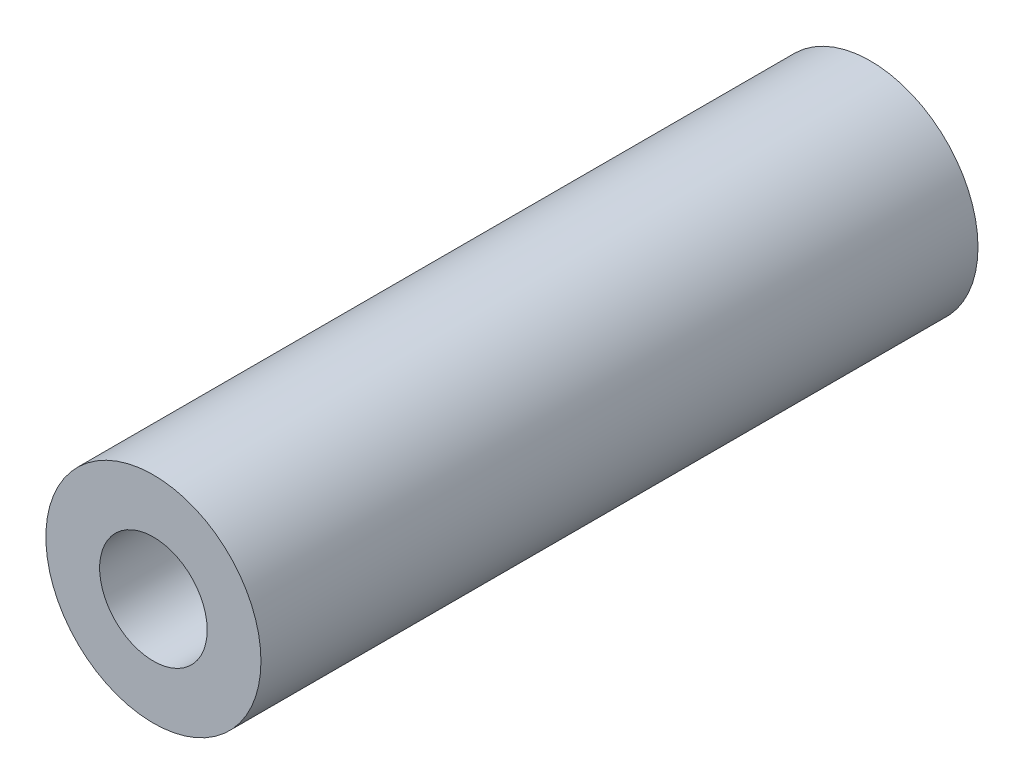
ISO-10303-21;
HEADER;
FILE_DESCRIPTION(('STEP AP214'),'2;1');
FILE_NAME('part.step','',(''),(''),'','','');
FILE_SCHEMA(('AUTOMOTIVE_DESIGN { 1 0 10303 214 1 1 1 1 }'));
ENDSEC;
DATA;
#1=APPLICATION_CONTEXT('core data for automotive mechanical design processes');
#2=APPLICATION_PROTOCOL_DEFINITION('international standard','automotive_design',2000,#1);
#3=PRODUCT_CONTEXT('',#1,'mechanical');
#4=PRODUCT('Part','Part','',(#3));
#5=PRODUCT_RELATED_PRODUCT_CATEGORY('part','',(#4));
#6=PRODUCT_DEFINITION_FORMATION('','',#4);
#7=PRODUCT_DEFINITION_CONTEXT('part definition',#1,'design');
#8=PRODUCT_DEFINITION('design','',#6,#7);
#9=PRODUCT_DEFINITION_SHAPE('','',#8);
#10=(LENGTH_UNIT() NAMED_UNIT(*) SI_UNIT(.MILLI.,.METRE.));
#11=(NAMED_UNIT(*) PLANE_ANGLE_UNIT() SI_UNIT($,.RADIAN.));
#12=(NAMED_UNIT(*) SI_UNIT($,.STERADIAN.) SOLID_ANGLE_UNIT());
#13=UNCERTAINTY_MEASURE_WITH_UNIT(LENGTH_MEASURE(1.E-05),#10,'distance_accuracy_value','');
#14=(GEOMETRIC_REPRESENTATION_CONTEXT(3) GLOBAL_UNCERTAINTY_ASSIGNED_CONTEXT((#13)) GLOBAL_UNIT_ASSIGNED_CONTEXT((#10,
#11,#12)) REPRESENTATION_CONTEXT('',''));
#15=CARTESIAN_POINT('',(0.,0.,0.));
#16=DIRECTION('',(0.,0.,1.));
#17=DIRECTION('',(1.,0.,0.));
#18=AXIS2_PLACEMENT_3D('',#15,#16,#17);
#19=CARTESIAN_POINT('',(0.,0.,20.));
#20=DIRECTION('',(0.,0.,1.));
#21=DIRECTION('',(1.,0.,0.));
#22=AXIS2_PLACEMENT_3D('',#19,#20,#21);
#23=PLANE('',#22);
#24=CARTESIAN_POINT('',(0.,0.,20.));
#25=DIRECTION('',(0.,0.,1.));
#26=DIRECTION('',(1.,0.,0.));
#27=AXIS2_PLACEMENT_3D('',#24,#25,#26);
#28=CIRCLE('',#27,3.);
#29=CARTESIAN_POINT('',(3.,0.,20.));
#30=VERTEX_POINT('',#29);
#31=EDGE_CURVE('E10',#30,#30,#28,.T.);
#32=ORIENTED_EDGE('',*,*,#31,.T.);
#33=EDGE_LOOP('',(#32));
#34=FACE_BOUND('',#33,.T.);
#35=CARTESIAN_POINT('',(0.,0.,20.));
#36=DIRECTION('',(0.,0.,1.));
#37=DIRECTION('',(1.,0.,0.));
#38=AXIS2_PLACEMENT_3D('',#35,#36,#37);
#39=CIRCLE('',#38,1.5);
#40=CARTESIAN_POINT('',(1.5,0.,20.));
#41=VERTEX_POINT('',#40);
#42=EDGE_CURVE('E42',#41,#41,#39,.T.);
#43=ORIENTED_EDGE('',*,*,#42,.F.);
#44=EDGE_LOOP('',(#43));
#45=FACE_BOUND('',#44,.T.);
#46=ADVANCED_FACE('F31',(#34,#45),#23,.T.);
#47=CARTESIAN_POINT('',(0.,0.,0.));
#48=DIRECTION('',(0.,0.,1.));
#49=DIRECTION('',(1.,0.,0.));
#50=AXIS2_PLACEMENT_3D('',#47,#48,#49);
#51=PLANE('',#50);
#52=CARTESIAN_POINT('',(0.,0.,0.));
#53=DIRECTION('',(0.,0.,1.));
#54=DIRECTION('',(1.,0.,0.));
#55=AXIS2_PLACEMENT_3D('',#52,#53,#54);
#56=CIRCLE('',#55,3.);
#57=CARTESIAN_POINT('',(3.,0.,0.));
#58=VERTEX_POINT('',#57);
#59=EDGE_CURVE('E35',#58,#58,#56,.T.);
#60=ORIENTED_EDGE('',*,*,#59,.F.);
#61=EDGE_LOOP('',(#60));
#62=FACE_BOUND('',#61,.T.);
#63=CARTESIAN_POINT('',(0.,0.,0.));
#64=DIRECTION('',(0.,0.,1.));
#65=DIRECTION('',(1.,0.,0.));
#66=AXIS2_PLACEMENT_3D('',#63,#64,#65);
#67=CIRCLE('',#66,1.5);
#68=CARTESIAN_POINT('',(1.5,0.,0.));
#69=VERTEX_POINT('',#68);
#70=EDGE_CURVE('E44',#69,#69,#67,.T.);
#71=ORIENTED_EDGE('',*,*,#70,.T.);
#72=EDGE_LOOP('',(#71));
#73=FACE_BOUND('',#72,.T.);
#74=ADVANCED_FACE('F54',(#62,#73),#51,.F.);
#75=CARTESIAN_POINT('',(0.,0.,20.));
#76=DIRECTION('',(0.,0.,-1.));
#77=DIRECTION('',(-1.,0.,0.));
#78=AXIS2_PLACEMENT_3D('',#75,#76,#77);
#79=CYLINDRICAL_SURFACE('',#78,3.);
#80=ORIENTED_EDGE('',*,*,#31,.F.);
#81=EDGE_LOOP('',(#80));
#82=FACE_BOUND('',#81,.T.);
#83=ORIENTED_EDGE('',*,*,#59,.T.);
#84=EDGE_LOOP('',(#83));
#85=FACE_BOUND('',#84,.T.);
#86=ADVANCED_FACE('F33',(#82,#85),#79,.T.);
#87=CARTESIAN_POINT('',(0.,0.,20.));
#88=DIRECTION('',(0.,0.,-1.));
#89=DIRECTION('',(-1.,0.,0.));
#90=AXIS2_PLACEMENT_3D('',#87,#88,#89);
#91=CYLINDRICAL_SURFACE('',#90,1.5);
#92=ORIENTED_EDGE('',*,*,#42,.T.);
#93=EDGE_LOOP('',(#92));
#94=FACE_BOUND('',#93,.T.);
#95=ORIENTED_EDGE('',*,*,#70,.F.);
#96=EDGE_LOOP('',(#95));
#97=FACE_BOUND('',#96,.T.);
#98=ADVANCED_FACE('F50',(#94,#97),#91,.F.);
#99=CLOSED_SHELL('',(#46,#74,#86,#98));
#100=MANIFOLD_SOLID_BREP('B2',#99);
#101=ADVANCED_BREP_SHAPE_REPRESENTATION('',(#18,#100),#14);
#102=SHAPE_DEFINITION_REPRESENTATION(#9,#101);
ENDSEC;
END-ISO-10303-21;
